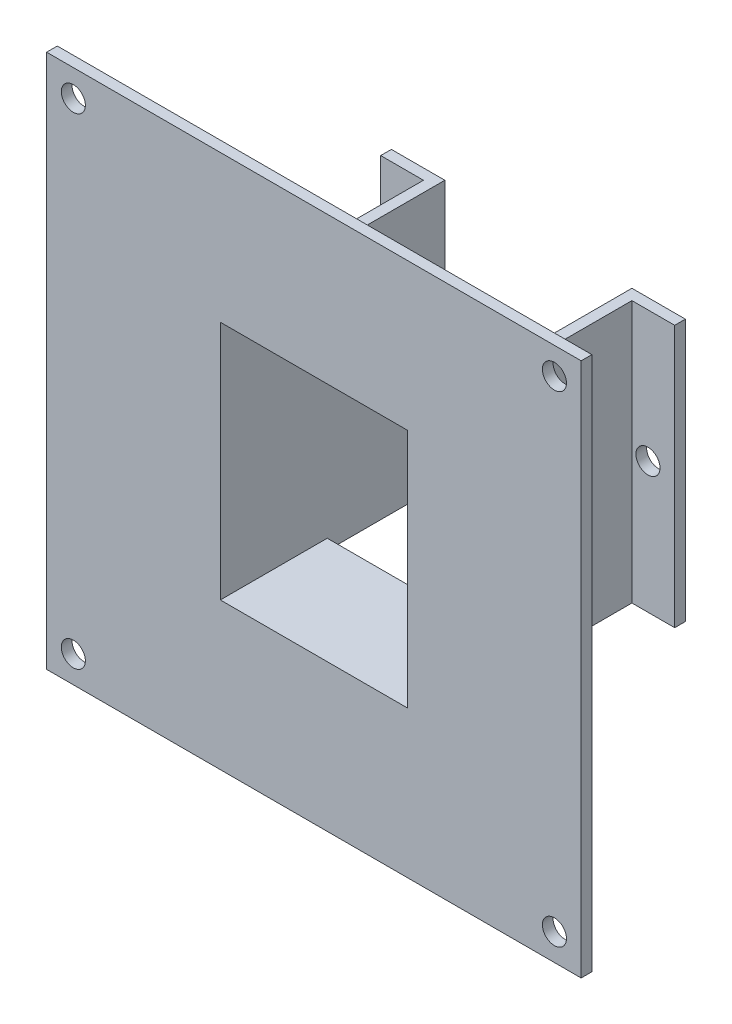
ISO-10303-21;
HEADER;
FILE_DESCRIPTION(('STEP AP214'),'2;1');
FILE_NAME('part.step','',(''),(''),'','','');
FILE_SCHEMA(('AUTOMOTIVE_DESIGN { 1 0 10303 214 1 1 1 1 }'));
ENDSEC;
DATA;
#1=APPLICATION_CONTEXT('core data for automotive mechanical design processes');
#2=APPLICATION_PROTOCOL_DEFINITION('international standard','automotive_design',2000,#1);
#3=PRODUCT_CONTEXT('',#1,'mechanical');
#4=PRODUCT('Part','Part','',(#3));
#5=PRODUCT_RELATED_PRODUCT_CATEGORY('part','',(#4));
#6=PRODUCT_DEFINITION_FORMATION('','',#4);
#7=PRODUCT_DEFINITION_CONTEXT('part definition',#1,'design');
#8=PRODUCT_DEFINITION('design','',#6,#7);
#9=PRODUCT_DEFINITION_SHAPE('','',#8);
#10=(LENGTH_UNIT() NAMED_UNIT(*) SI_UNIT(.MILLI.,.METRE.));
#11=(NAMED_UNIT(*) PLANE_ANGLE_UNIT() SI_UNIT($,.RADIAN.));
#12=(NAMED_UNIT(*) SI_UNIT($,.STERADIAN.) SOLID_ANGLE_UNIT());
#13=UNCERTAINTY_MEASURE_WITH_UNIT(LENGTH_MEASURE(1.E-05),#10,'distance_accuracy_value','');
#14=(GEOMETRIC_REPRESENTATION_CONTEXT(3) GLOBAL_UNCERTAINTY_ASSIGNED_CONTEXT((#13)) GLOBAL_UNIT_ASSIGNED_CONTEXT((#10,
#11,#12)) REPRESENTATION_CONTEXT('',''));
#15=CARTESIAN_POINT('',(0.,0.,0.));
#16=DIRECTION('',(0.,0.,1.));
#17=DIRECTION('',(1.,0.,0.));
#18=AXIS2_PLACEMENT_3D('',#15,#16,#17);
#19=CARTESIAN_POINT('',(-22.5,0.,-40.));
#20=DIRECTION('',(0.,0.,-1.));
#21=DIRECTION('',(-1.,0.,0.));
#22=AXIS2_PLACEMENT_3D('',#19,#20,#21);
#23=CYLINDRICAL_SURFACE('',#22,2.25);
#24=CARTESIAN_POINT('',(-22.5,0.,-38.));
#25=DIRECTION('',(0.,0.,-1.));
#26=DIRECTION('',(-1.,0.,0.));
#27=AXIS2_PLACEMENT_3D('',#24,#25,#26);
#28=CIRCLE('',#27,2.25);
#29=CARTESIAN_POINT('',(-24.75,0.,-38.));
#30=VERTEX_POINT('',#29);
#31=EDGE_CURVE('E19',#30,#30,#28,.F.);
#32=ORIENTED_EDGE('',*,*,#31,.T.);
#33=EDGE_LOOP('',(#32));
#34=FACE_BOUND('',#33,.T.);
#35=CARTESIAN_POINT('',(-22.5,0.,-40.));
#36=DIRECTION('',(0.,0.,-1.));
#37=DIRECTION('',(-1.,0.,0.));
#38=AXIS2_PLACEMENT_3D('',#35,#36,#37);
#39=CIRCLE('',#38,2.25);
#40=CARTESIAN_POINT('',(-24.75,0.,-40.));
#41=VERTEX_POINT('',#40);
#42=EDGE_CURVE('E180',#41,#41,#39,.F.);
#43=ORIENTED_EDGE('',*,*,#42,.F.);
#44=EDGE_LOOP('',(#43));
#45=FACE_BOUND('',#44,.T.);
#46=ADVANCED_FACE('F16',(#34,#45),#23,.F.);
#47=CARTESIAN_POINT('',(22.5,0.,-40.));
#48=DIRECTION('',(0.,0.,-1.));
#49=DIRECTION('',(-1.,0.,0.));
#50=AXIS2_PLACEMENT_3D('',#47,#48,#49);
#51=CYLINDRICAL_SURFACE('',#50,2.25);
#52=CARTESIAN_POINT('',(22.5,0.,-38.));
#53=DIRECTION('',(0.,0.,-1.));
#54=DIRECTION('',(-1.,0.,0.));
#55=AXIS2_PLACEMENT_3D('',#52,#53,#54);
#56=CIRCLE('',#55,2.25);
#57=CARTESIAN_POINT('',(20.25,0.,-38.));
#58=VERTEX_POINT('',#57);
#59=EDGE_CURVE('E190',#58,#58,#56,.F.);
#60=ORIENTED_EDGE('',*,*,#59,.T.);
#61=EDGE_LOOP('',(#60));
#62=FACE_BOUND('',#61,.T.);
#63=CARTESIAN_POINT('',(22.5,0.,-40.));
#64=DIRECTION('',(0.,0.,-1.));
#65=DIRECTION('',(-1.,0.,0.));
#66=AXIS2_PLACEMENT_3D('',#63,#64,#65);
#67=CIRCLE('',#66,2.25);
#68=CARTESIAN_POINT('',(20.25,0.,-40.));
#69=VERTEX_POINT('',#68);
#70=EDGE_CURVE('E214',#69,#69,#67,.F.);
#71=ORIENTED_EDGE('',*,*,#70,.F.);
#72=EDGE_LOOP('',(#71));
#73=FACE_BOUND('',#72,.T.);
#74=ADVANCED_FACE('F238',(#62,#73),#51,.F.);
#75=CARTESIAN_POINT('',(-27.5,-22.5,-40.));
#76=DIRECTION('',(-1.,0.,0.));
#77=DIRECTION('',(0.,0.,1.));
#78=AXIS2_PLACEMENT_3D('',#75,#76,#77);
#79=PLANE('',#78);
#80=DIRECTION('',(0.,0.,1.));
#81=VECTOR('',#80,1.);
#82=CARTESIAN_POINT('',(-27.5,24.5,0.));
#83=LINE('',#82,#81);
#84=CARTESIAN_POINT('',(-27.5,24.5,-40.));
#85=VERTEX_POINT('',#84);
#86=CARTESIAN_POINT('',(-27.5,24.5,-38.));
#87=VERTEX_POINT('',#86);
#88=EDGE_CURVE('E367',#85,#87,#83,.T.);
#89=ORIENTED_EDGE('',*,*,#88,.F.);
#90=DIRECTION('',(0.,1.,0.));
#91=VECTOR('',#90,1.);
#92=CARTESIAN_POINT('',(-27.5,0.,-40.));
#93=LINE('',#92,#91);
#94=CARTESIAN_POINT('',(-27.5,-24.5,-40.));
#95=VERTEX_POINT('',#94);
#96=EDGE_CURVE('E183',#95,#85,#93,.T.);
#97=ORIENTED_EDGE('',*,*,#96,.F.);
#98=DIRECTION('',(0.,0.,-1.));
#99=VECTOR('',#98,1.);
#100=CARTESIAN_POINT('',(-27.5,-24.5,0.));
#101=LINE('',#100,#99);
#102=CARTESIAN_POINT('',(-27.5,-24.5,-38.));
#103=VERTEX_POINT('',#102);
#104=EDGE_CURVE('E172',#103,#95,#101,.T.);
#105=ORIENTED_EDGE('',*,*,#104,.F.);
#106=DIRECTION('',(0.,1.,0.));
#107=VECTOR('',#106,1.);
#108=CARTESIAN_POINT('',(-27.5,0.,-38.));
#109=LINE('',#108,#107);
#110=EDGE_CURVE('E151',#103,#87,#109,.T.);
#111=ORIENTED_EDGE('',*,*,#110,.T.);
#112=EDGE_LOOP('',(#89,#97,#105,#111));
#113=FACE_BOUND('',#112,.T.);
#114=ADVANCED_FACE('F228',(#113),#79,.T.);
#115=CARTESIAN_POINT('',(0.,0.,-38.));
#116=DIRECTION('',(0.,0.,-1.));
#117=DIRECTION('',(-1.,0.,0.));
#118=AXIS2_PLACEMENT_3D('',#115,#116,#117);
#119=PLANE('',#118);
#120=ORIENTED_EDGE('',*,*,#31,.F.);
#121=EDGE_LOOP('',(#120));
#122=FACE_BOUND('',#121,.T.);
#123=ORIENTED_EDGE('',*,*,#110,.F.);
#124=DIRECTION('',(1.,0.,0.));
#125=VECTOR('',#124,1.);
#126=CARTESIAN_POINT('',(-17.5,-24.5,-38.));
#127=LINE('',#126,#125);
#128=CARTESIAN_POINT('',(-19.5,-24.5,-38.));
#129=VERTEX_POINT('',#128);
#130=EDGE_CURVE('E168',#129,#103,#127,.F.);
#131=ORIENTED_EDGE('',*,*,#130,.F.);
#132=DIRECTION('',(0.,1.,0.));
#133=VECTOR('',#132,1.);
#134=CARTESIAN_POINT('',(-19.5,-22.5,-38.));
#135=LINE('',#134,#133);
#136=CARTESIAN_POINT('',(-19.5,24.5,-38.));
#137=VERTEX_POINT('',#136);
#138=EDGE_CURVE('E156',#137,#129,#135,.F.);
#139=ORIENTED_EDGE('',*,*,#138,.F.);
#140=DIRECTION('',(1.,0.,0.));
#141=VECTOR('',#140,1.);
#142=CARTESIAN_POINT('',(-19.5,24.5,-38.));
#143=LINE('',#142,#141);
#144=EDGE_CURVE('E428',#87,#137,#143,.T.);
#145=ORIENTED_EDGE('',*,*,#144,.F.);
#146=EDGE_LOOP('',(#123,#131,#139,#145));
#147=FACE_BOUND('',#146,.T.);
#148=ADVANCED_FACE('F169',(#122,#147),#119,.F.);
#149=CARTESIAN_POINT('',(0.,0.,-38.));
#150=DIRECTION('',(0.,0.,-1.));
#151=DIRECTION('',(-1.,0.,0.));
#152=AXIS2_PLACEMENT_3D('',#149,#150,#151);
#153=PLANE('',#152);
#154=ORIENTED_EDGE('',*,*,#59,.F.);
#155=EDGE_LOOP('',(#154));
#156=FACE_BOUND('',#155,.T.);
#157=DIRECTION('',(0.,1.,0.));
#158=VECTOR('',#157,1.);
#159=CARTESIAN_POINT('',(27.5,22.5,-38.));
#160=LINE('',#159,#158);
#161=CARTESIAN_POINT('',(27.5,24.5,-38.));
#162=VERTEX_POINT('',#161);
#163=CARTESIAN_POINT('',(27.5,-24.5,-38.));
#164=VERTEX_POINT('',#163);
#165=EDGE_CURVE('E165',#162,#164,#160,.F.);
#166=ORIENTED_EDGE('',*,*,#165,.F.);
#167=DIRECTION('',(1.,0.,0.));
#168=VECTOR('',#167,1.);
#169=CARTESIAN_POINT('',(-19.5,24.5,-38.));
#170=LINE('',#169,#168);
#171=CARTESIAN_POINT('',(19.5,24.5,-38.));
#172=VERTEX_POINT('',#171);
#173=EDGE_CURVE('E421',#172,#162,#170,.T.);
#174=ORIENTED_EDGE('',*,*,#173,.F.);
#175=DIRECTION('',(0.,1.,0.));
#176=VECTOR('',#175,1.);
#177=CARTESIAN_POINT('',(19.5,22.5,-38.));
#178=LINE('',#177,#176);
#179=CARTESIAN_POINT('',(19.5,-24.5,-38.));
#180=VERTEX_POINT('',#179);
#181=EDGE_CURVE('E164',#180,#172,#178,.T.);
#182=ORIENTED_EDGE('',*,*,#181,.F.);
#183=DIRECTION('',(1.,0.,0.));
#184=VECTOR('',#183,1.);
#185=CARTESIAN_POINT('',(-17.5,-24.5,-38.));
#186=LINE('',#185,#184);
#187=EDGE_CURVE('E340',#164,#180,#186,.F.);
#188=ORIENTED_EDGE('',*,*,#187,.F.);
#189=EDGE_LOOP('',(#166,#174,#182,#188));
#190=FACE_BOUND('',#189,.T.);
#191=ADVANCED_FACE('F227',(#156,#190),#153,.F.);
#192=CARTESIAN_POINT('',(27.5,22.5,-40.));
#193=DIRECTION('',(1.,0.,0.));
#194=DIRECTION('',(0.,0.,-1.));
#195=AXIS2_PLACEMENT_3D('',#192,#193,#194);
#196=PLANE('',#195);
#197=DIRECTION('',(0.,0.,-1.));
#198=VECTOR('',#197,1.);
#199=CARTESIAN_POINT('',(27.5,-24.5,0.));
#200=LINE('',#199,#198);
#201=CARTESIAN_POINT('',(27.5,-24.5,-40.));
#202=VERTEX_POINT('',#201);
#203=EDGE_CURVE('E333',#202,#164,#200,.F.);
#204=ORIENTED_EDGE('',*,*,#203,.F.);
#205=DIRECTION('',(0.,1.,0.));
#206=VECTOR('',#205,1.);
#207=CARTESIAN_POINT('',(27.5,0.,-40.));
#208=LINE('',#207,#206);
#209=CARTESIAN_POINT('',(27.5,24.5,-40.));
#210=VERTEX_POINT('',#209);
#211=EDGE_CURVE('E337',#210,#202,#208,.F.);
#212=ORIENTED_EDGE('',*,*,#211,.F.);
#213=DIRECTION('',(0.,0.,1.));
#214=VECTOR('',#213,1.);
#215=CARTESIAN_POINT('',(27.5,24.5,0.));
#216=LINE('',#215,#214);
#217=EDGE_CURVE('E419',#162,#210,#216,.F.);
#218=ORIENTED_EDGE('',*,*,#217,.F.);
#219=ORIENTED_EDGE('',*,*,#165,.T.);
#220=EDGE_LOOP('',(#204,#212,#218,#219));
#221=FACE_BOUND('',#220,.T.);
#222=ADVANCED_FACE('F235',(#221),#196,.T.);
#223=CARTESIAN_POINT('',(-19.5,-22.5,0.));
#224=DIRECTION('',(-1.,0.,0.));
#225=DIRECTION('',(0.,0.,1.));
#226=AXIS2_PLACEMENT_3D('',#223,#224,#225);
#227=PLANE('',#226);
#228=DIRECTION('',(0.,0.,1.));
#229=VECTOR('',#228,1.);
#230=CARTESIAN_POINT('',(-19.5,24.5,0.));
#231=LINE('',#230,#229);
#232=CARTESIAN_POINT('',(-19.5,24.5,0.));
#233=VERTEX_POINT('',#232);
#234=EDGE_CURVE('E162',#137,#233,#231,.T.);
#235=ORIENTED_EDGE('',*,*,#234,.F.);
#236=ORIENTED_EDGE('',*,*,#138,.T.);
#237=DIRECTION('',(0.,0.,-1.));
#238=VECTOR('',#237,1.);
#239=CARTESIAN_POINT('',(-19.5,-24.5,0.));
#240=LINE('',#239,#238);
#241=CARTESIAN_POINT('',(-19.5,-24.5,0.));
#242=VERTEX_POINT('',#241);
#243=EDGE_CURVE('E159',#242,#129,#240,.T.);
#244=ORIENTED_EDGE('',*,*,#243,.F.);
#245=DIRECTION('',(0.,1.,0.));
#246=VECTOR('',#245,1.);
#247=CARTESIAN_POINT('',(-19.5,0.,0.));
#248=LINE('',#247,#246);
#249=EDGE_CURVE('E414',#242,#233,#248,.T.);
#250=ORIENTED_EDGE('',*,*,#249,.T.);
#251=EDGE_LOOP('',(#235,#236,#244,#250));
#252=FACE_BOUND('',#251,.T.);
#253=ADVANCED_FACE('F157',(#252),#227,.T.);
#254=CARTESIAN_POINT('',(19.5,22.5,0.));
#255=DIRECTION('',(1.,0.,0.));
#256=DIRECTION('',(0.,0.,-1.));
#257=AXIS2_PLACEMENT_3D('',#254,#255,#256);
#258=PLANE('',#257);
#259=DIRECTION('',(0.,0.,-1.));
#260=VECTOR('',#259,1.);
#261=CARTESIAN_POINT('',(19.5,-24.5,0.));
#262=LINE('',#261,#260);
#263=CARTESIAN_POINT('',(19.5,-24.5,0.));
#264=VERTEX_POINT('',#263);
#265=EDGE_CURVE('E353',#180,#264,#262,.F.);
#266=ORIENTED_EDGE('',*,*,#265,.F.);
#267=ORIENTED_EDGE('',*,*,#181,.T.);
#268=DIRECTION('',(0.,0.,1.));
#269=VECTOR('',#268,1.);
#270=CARTESIAN_POINT('',(19.5,24.5,0.));
#271=LINE('',#270,#269);
#272=CARTESIAN_POINT('',(19.5,24.5,0.));
#273=VERTEX_POINT('',#272);
#274=EDGE_CURVE('E424',#273,#172,#271,.F.);
#275=ORIENTED_EDGE('',*,*,#274,.F.);
#276=DIRECTION('',(0.,1.,0.));
#277=VECTOR('',#276,1.);
#278=CARTESIAN_POINT('',(19.5,0.,0.));
#279=LINE('',#278,#277);
#280=EDGE_CURVE('E409',#273,#264,#279,.F.);
#281=ORIENTED_EDGE('',*,*,#280,.T.);
#282=EDGE_LOOP('',(#266,#267,#275,#281));
#283=FACE_BOUND('',#282,.T.);
#284=ADVANCED_FACE('F321',(#283),#258,.T.);
#285=CARTESIAN_POINT('',(0.,0.,-40.));
#286=DIRECTION('',(0.,0.,-1.));
#287=DIRECTION('',(-1.,0.,0.));
#288=AXIS2_PLACEMENT_3D('',#285,#286,#287);
#289=PLANE('',#288);
#290=ORIENTED_EDGE('',*,*,#42,.T.);
#291=EDGE_LOOP('',(#290));
#292=FACE_BOUND('',#291,.T.);
#293=ORIENTED_EDGE('',*,*,#96,.T.);
#294=DIRECTION('',(1.,0.,0.));
#295=VECTOR('',#294,1.);
#296=CARTESIAN_POINT('',(-19.5,24.5,-40.));
#297=LINE('',#296,#295);
#298=CARTESIAN_POINT('',(-17.5,24.5,-40.));
#299=VERTEX_POINT('',#298);
#300=EDGE_CURVE('E216',#299,#85,#297,.F.);
#301=ORIENTED_EDGE('',*,*,#300,.F.);
#302=DIRECTION('',(0.,1.,0.));
#303=VECTOR('',#302,1.);
#304=CARTESIAN_POINT('',(-17.5,22.5,-40.));
#305=LINE('',#304,#303);
#306=CARTESIAN_POINT('',(-17.5,-24.5,-40.));
#307=VERTEX_POINT('',#306);
#308=EDGE_CURVE('E371',#299,#307,#305,.F.);
#309=ORIENTED_EDGE('',*,*,#308,.T.);
#310=DIRECTION('',(1.,0.,0.));
#311=VECTOR('',#310,1.);
#312=CARTESIAN_POINT('',(-17.5,-24.5,-40.));
#313=LINE('',#312,#311);
#314=EDGE_CURVE('E360',#95,#307,#313,.T.);
#315=ORIENTED_EDGE('',*,*,#314,.F.);
#316=EDGE_LOOP('',(#293,#301,#309,#315));
#317=FACE_BOUND('',#316,.T.);
#318=ADVANCED_FACE('F317',(#292,#317),#289,.T.);
#319=CARTESIAN_POINT('',(0.,0.,-18.));
#320=DIRECTION('',(0.,0.,1.));
#321=DIRECTION('',(1.,0.,0.));
#322=AXIS2_PLACEMENT_3D('',#319,#320,#321);
#323=PLANE('',#322);
#324=DIRECTION('',(1.,0.,0.));
#325=VECTOR('',#324,1.);
#326=CARTESIAN_POINT('',(-17.5,-24.5,-18.));
#327=LINE('',#326,#325);
#328=CARTESIAN_POINT('',(-17.5,-24.5,-18.));
#329=VERTEX_POINT('',#328);
#330=CARTESIAN_POINT('',(17.5,-24.5,-18.));
#331=VERTEX_POINT('',#330);
#332=EDGE_CURVE('E341',#329,#331,#327,.T.);
#333=ORIENTED_EDGE('',*,*,#332,.F.);
#334=DIRECTION('',(0.,1.,0.));
#335=VECTOR('',#334,1.);
#336=CARTESIAN_POINT('',(-17.5,22.5,-18.));
#337=LINE('',#336,#335);
#338=CARTESIAN_POINT('',(-17.5,-22.5,-18.));
#339=VERTEX_POINT('',#338);
#340=EDGE_CURVE('E377',#329,#339,#337,.T.);
#341=ORIENTED_EDGE('',*,*,#340,.T.);
#342=DIRECTION('',(1.,0.,0.));
#343=VECTOR('',#342,1.);
#344=CARTESIAN_POINT('',(-17.5,-22.5,-18.));
#345=LINE('',#344,#343);
#346=CARTESIAN_POINT('',(17.5,-22.5,-18.));
#347=VERTEX_POINT('',#346);
#348=EDGE_CURVE('E385',#339,#347,#345,.T.);
#349=ORIENTED_EDGE('',*,*,#348,.T.);
#350=DIRECTION('',(0.,1.,0.));
#351=VECTOR('',#350,1.);
#352=CARTESIAN_POINT('',(17.5,-22.5,-18.));
#353=LINE('',#352,#351);
#354=EDGE_CURVE('E481',#347,#331,#353,.F.);
#355=ORIENTED_EDGE('',*,*,#354,.T.);
#356=EDGE_LOOP('',(#333,#341,#349,#355));
#357=FACE_BOUND('',#356,.T.);
#358=ADVANCED_FACE('F314',(#357),#323,.F.);
#359=CARTESIAN_POINT('',(-17.5,-24.5,0.));
#360=DIRECTION('',(0.,-1.,0.));
#361=DIRECTION('',(0.,0.,-1.));
#362=AXIS2_PLACEMENT_3D('',#359,#360,#361);
#363=PLANE('',#362);
#364=ORIENTED_EDGE('',*,*,#187,.T.);
#365=ORIENTED_EDGE('',*,*,#265,.T.);
#366=DIRECTION('',(1.,0.,0.));
#367=VECTOR('',#366,1.);
#368=CARTESIAN_POINT('',(0.,-24.5,0.));
#369=LINE('',#368,#367);
#370=EDGE_CURVE('E178',#264,#242,#369,.F.);
#371=ORIENTED_EDGE('',*,*,#370,.T.);
#372=ORIENTED_EDGE('',*,*,#243,.T.);
#373=ORIENTED_EDGE('',*,*,#130,.T.);
#374=ORIENTED_EDGE('',*,*,#104,.T.);
#375=ORIENTED_EDGE('',*,*,#314,.T.);
#376=DIRECTION('',(0.,0.,1.));
#377=VECTOR('',#376,1.);
#378=CARTESIAN_POINT('',(-17.5,-24.5,2.));
#379=LINE('',#378,#377);
#380=EDGE_CURVE('E374',#307,#329,#379,.T.);
#381=ORIENTED_EDGE('',*,*,#380,.T.);
#382=ORIENTED_EDGE('',*,*,#332,.T.);
#383=DIRECTION('',(0.,0.,-1.));
#384=VECTOR('',#383,1.);
#385=CARTESIAN_POINT('',(17.5,-24.5,2.));
#386=LINE('',#385,#384);
#387=CARTESIAN_POINT('',(17.5,-24.5,-40.));
#388=VERTEX_POINT('',#387);
#389=EDGE_CURVE('E346',#331,#388,#386,.T.);
#390=ORIENTED_EDGE('',*,*,#389,.T.);
#391=DIRECTION('',(-1.,0.,0.));
#392=VECTOR('',#391,1.);
#393=CARTESIAN_POINT('',(0.,-24.5,-40.));
#394=LINE('',#393,#392);
#395=EDGE_CURVE('E217',#202,#388,#394,.T.);
#396=ORIENTED_EDGE('',*,*,#395,.F.);
#397=ORIENTED_EDGE('',*,*,#203,.T.);
#398=EDGE_LOOP('',(#364,#365,#371,#372,#373,#374,#375,#381,#382,#390,#396,#397));
#399=FACE_BOUND('',#398,.T.);
#400=ADVANCED_FACE('F175',(#399),#363,.T.);
#401=CARTESIAN_POINT('',(0.,0.,-40.));
#402=DIRECTION('',(0.,0.,-1.));
#403=DIRECTION('',(-1.,0.,0.));
#404=AXIS2_PLACEMENT_3D('',#401,#402,#403);
#405=PLANE('',#404);
#406=ORIENTED_EDGE('',*,*,#70,.T.);
#407=EDGE_LOOP('',(#406));
#408=FACE_BOUND('',#407,.T.);
#409=ORIENTED_EDGE('',*,*,#211,.T.);
#410=ORIENTED_EDGE('',*,*,#395,.T.);
#411=DIRECTION('',(0.,1.,0.));
#412=VECTOR('',#411,1.);
#413=CARTESIAN_POINT('',(17.5,-22.5,-40.));
#414=LINE('',#413,#412);
#415=CARTESIAN_POINT('',(17.5,24.5,-40.));
#416=VERTEX_POINT('',#415);
#417=EDGE_CURVE('E478',#388,#416,#414,.T.);
#418=ORIENTED_EDGE('',*,*,#417,.T.);
#419=DIRECTION('',(1.,0.,0.));
#420=VECTOR('',#419,1.);
#421=CARTESIAN_POINT('',(-19.5,24.5,-40.));
#422=LINE('',#421,#420);
#423=EDGE_CURVE('E351',#210,#416,#422,.F.);
#424=ORIENTED_EDGE('',*,*,#423,.F.);
#425=EDGE_LOOP('',(#409,#410,#418,#424));
#426=FACE_BOUND('',#425,.T.);
#427=ADVANCED_FACE('F307',(#408,#426),#405,.T.);
#428=CARTESIAN_POINT('',(-19.5,24.5,0.));
#429=DIRECTION('',(0.,1.,0.));
#430=DIRECTION('',(0.,0.,1.));
#431=AXIS2_PLACEMENT_3D('',#428,#429,#430);
#432=PLANE('',#431);
#433=ORIENTED_EDGE('',*,*,#217,.T.);
#434=ORIENTED_EDGE('',*,*,#423,.T.);
#435=DIRECTION('',(0.,0.,-1.));
#436=VECTOR('',#435,1.);
#437=CARTESIAN_POINT('',(17.5,24.5,2.));
#438=LINE('',#437,#436);
#439=CARTESIAN_POINT('',(17.5,24.5,-18.));
#440=VERTEX_POINT('',#439);
#441=EDGE_CURVE('E476',#416,#440,#438,.F.);
#442=ORIENTED_EDGE('',*,*,#441,.T.);
#443=DIRECTION('',(1.,0.,0.));
#444=VECTOR('',#443,1.);
#445=CARTESIAN_POINT('',(0.,24.5,-18.));
#446=LINE('',#445,#444);
#447=CARTESIAN_POINT('',(-17.5,24.5,-18.));
#448=VERTEX_POINT('',#447);
#449=EDGE_CURVE('E416',#440,#448,#446,.F.);
#450=ORIENTED_EDGE('',*,*,#449,.T.);
#451=DIRECTION('',(0.,0.,1.));
#452=VECTOR('',#451,1.);
#453=CARTESIAN_POINT('',(-17.5,24.5,2.));
#454=LINE('',#453,#452);
#455=EDGE_CURVE('E375',#448,#299,#454,.F.);
#456=ORIENTED_EDGE('',*,*,#455,.T.);
#457=ORIENTED_EDGE('',*,*,#300,.T.);
#458=ORIENTED_EDGE('',*,*,#88,.T.);
#459=ORIENTED_EDGE('',*,*,#144,.T.);
#460=ORIENTED_EDGE('',*,*,#234,.T.);
#461=DIRECTION('',(1.,0.,0.));
#462=VECTOR('',#461,1.);
#463=CARTESIAN_POINT('',(0.,24.5,0.));
#464=LINE('',#463,#462);
#465=EDGE_CURVE('E411',#233,#273,#464,.T.);
#466=ORIENTED_EDGE('',*,*,#465,.T.);
#467=ORIENTED_EDGE('',*,*,#274,.T.);
#468=ORIENTED_EDGE('',*,*,#173,.T.);
#469=EDGE_LOOP('',(#433,#434,#442,#450,#456,#457,#458,#459,#460,#466,#467,#468));
#470=FACE_BOUND('',#469,.T.);
#471=ADVANCED_FACE('F303',(#470),#432,.T.);
#472=CARTESIAN_POINT('',(0.,0.,-18.));
#473=DIRECTION('',(0.,0.,1.));
#474=DIRECTION('',(1.,0.,0.));
#475=AXIS2_PLACEMENT_3D('',#472,#473,#474);
#476=PLANE('',#475);
#477=ORIENTED_EDGE('',*,*,#449,.F.);
#478=DIRECTION('',(0.,1.,0.));
#479=VECTOR('',#478,1.);
#480=CARTESIAN_POINT('',(17.5,-22.5,-18.));
#481=LINE('',#480,#479);
#482=CARTESIAN_POINT('',(17.5,22.5,-18.));
#483=VERTEX_POINT('',#482);
#484=EDGE_CURVE('E438',#440,#483,#481,.F.);
#485=ORIENTED_EDGE('',*,*,#484,.T.);
#486=DIRECTION('',(1.,0.,0.));
#487=VECTOR('',#486,1.);
#488=CARTESIAN_POINT('',(17.5,22.5,-18.));
#489=LINE('',#488,#487);
#490=CARTESIAN_POINT('',(-17.5,22.5,-18.));
#491=VERTEX_POINT('',#490);
#492=EDGE_CURVE('E436',#483,#491,#489,.F.);
#493=ORIENTED_EDGE('',*,*,#492,.T.);
#494=DIRECTION('',(0.,1.,0.));
#495=VECTOR('',#494,1.);
#496=CARTESIAN_POINT('',(-17.5,22.5,-18.));
#497=LINE('',#496,#495);
#498=EDGE_CURVE('E379',#491,#448,#497,.T.);
#499=ORIENTED_EDGE('',*,*,#498,.T.);
#500=EDGE_LOOP('',(#477,#485,#493,#499));
#501=FACE_BOUND('',#500,.T.);
#502=ADVANCED_FACE('F299',(#501),#476,.F.);
#503=CARTESIAN_POINT('',(0.,0.,0.));
#504=DIRECTION('',(0.,0.,1.));
#505=DIRECTION('',(1.,0.,0.));
#506=AXIS2_PLACEMENT_3D('',#503,#504,#505);
#507=PLANE('',#506);
#508=ORIENTED_EDGE('',*,*,#280,.F.);
#509=ORIENTED_EDGE('',*,*,#465,.F.);
#510=ORIENTED_EDGE('',*,*,#249,.F.);
#511=ORIENTED_EDGE('',*,*,#370,.F.);
#512=EDGE_LOOP('',(#508,#509,#510,#511));
#513=FACE_BOUND('',#512,.T.);
#514=CARTESIAN_POINT('',(-45.,-45.,0.));
#515=DIRECTION('',(0.,0.,1.));
#516=DIRECTION('',(1.,0.,0.));
#517=AXIS2_PLACEMENT_3D('',#514,#515,#516);
#518=CIRCLE('',#517,2.25);
#519=CARTESIAN_POINT('',(-42.75,-45.,0.));
#520=VERTEX_POINT('',#519);
#521=EDGE_CURVE('E201',#520,#520,#518,.T.);
#522=ORIENTED_EDGE('',*,*,#521,.T.);
#523=EDGE_LOOP('',(#522));
#524=FACE_BOUND('',#523,.T.);
#525=CARTESIAN_POINT('',(45.,-45.,0.));
#526=DIRECTION('',(0.,0.,1.));
#527=DIRECTION('',(1.,0.,0.));
#528=AXIS2_PLACEMENT_3D('',#525,#526,#527);
#529=CIRCLE('',#528,2.25);
#530=CARTESIAN_POINT('',(47.25,-45.,0.));
#531=VERTEX_POINT('',#530);
#532=EDGE_CURVE('E205',#531,#531,#529,.T.);
#533=ORIENTED_EDGE('',*,*,#532,.T.);
#534=EDGE_LOOP('',(#533));
#535=FACE_BOUND('',#534,.T.);
#536=CARTESIAN_POINT('',(45.,45.,0.));
#537=DIRECTION('',(0.,0.,1.));
#538=DIRECTION('',(1.,0.,0.));
#539=AXIS2_PLACEMENT_3D('',#536,#537,#538);
#540=CIRCLE('',#539,2.25);
#541=CARTESIAN_POINT('',(47.25,45.,0.));
#542=VERTEX_POINT('',#541);
#543=EDGE_CURVE('E208',#542,#542,#540,.T.);
#544=ORIENTED_EDGE('',*,*,#543,.T.);
#545=EDGE_LOOP('',(#544));
#546=FACE_BOUND('',#545,.T.);
#547=CARTESIAN_POINT('',(-45.,45.,0.));
#548=DIRECTION('',(0.,0.,1.));
#549=DIRECTION('',(1.,0.,0.));
#550=AXIS2_PLACEMENT_3D('',#547,#548,#549);
#551=CIRCLE('',#550,2.25);
#552=CARTESIAN_POINT('',(-42.75,45.,0.));
#553=VERTEX_POINT('',#552);
#554=EDGE_CURVE('E211',#553,#553,#551,.T.);
#555=ORIENTED_EDGE('',*,*,#554,.T.);
#556=EDGE_LOOP('',(#555));
#557=FACE_BOUND('',#556,.T.);
#558=DIRECTION('',(0.,1.,0.));
#559=VECTOR('',#558,1.);
#560=CARTESIAN_POINT('',(50.,-50.,0.));
#561=LINE('',#560,#559);
#562=CARTESIAN_POINT('',(50.,-50.,0.));
#563=VERTEX_POINT('',#562);
#564=CARTESIAN_POINT('',(50.,50.,0.));
#565=VERTEX_POINT('',#564);
#566=EDGE_CURVE('E401',#563,#565,#561,.T.);
#567=ORIENTED_EDGE('',*,*,#566,.F.);
#568=DIRECTION('',(1.,0.,0.));
#569=VECTOR('',#568,1.);
#570=CARTESIAN_POINT('',(-50.,-50.,0.));
#571=LINE('',#570,#569);
#572=CARTESIAN_POINT('',(-50.,-50.,0.));
#573=VERTEX_POINT('',#572);
#574=EDGE_CURVE('E406',#573,#563,#571,.T.);
#575=ORIENTED_EDGE('',*,*,#574,.F.);
#576=DIRECTION('',(0.,1.,0.));
#577=VECTOR('',#576,1.);
#578=CARTESIAN_POINT('',(-50.,50.,0.));
#579=LINE('',#578,#577);
#580=CARTESIAN_POINT('',(-50.,50.,0.));
#581=VERTEX_POINT('',#580);
#582=EDGE_CURVE('E387',#581,#573,#579,.F.);
#583=ORIENTED_EDGE('',*,*,#582,.F.);
#584=DIRECTION('',(1.,0.,0.));
#585=VECTOR('',#584,1.);
#586=CARTESIAN_POINT('',(50.,50.,0.));
#587=LINE('',#586,#585);
#588=EDGE_CURVE('E396',#565,#581,#587,.F.);
#589=ORIENTED_EDGE('',*,*,#588,.F.);
#590=EDGE_LOOP('',(#567,#575,#583,#589));
#591=FACE_BOUND('',#590,.T.);
#592=ADVANCED_FACE('F295',(#513,#524,#535,#546,#557,#591),#507,.F.);
#593=CARTESIAN_POINT('',(-50.,-50.,0.));
#594=DIRECTION('',(0.,-1.,0.));
#595=DIRECTION('',(0.,0.,-1.));
#596=AXIS2_PLACEMENT_3D('',#593,#594,#595);
#597=PLANE('',#596);
#598=DIRECTION('',(0.,0.,1.));
#599=VECTOR('',#598,1.);
#600=CARTESIAN_POINT('',(-50.,-50.,0.));
#601=LINE('',#600,#599);
#602=CARTESIAN_POINT('',(-50.,-50.,2.));
#603=VERTEX_POINT('',#602);
#604=EDGE_CURVE('E393',#573,#603,#601,.T.);
#605=ORIENTED_EDGE('',*,*,#604,.F.);
#606=ORIENTED_EDGE('',*,*,#574,.T.);
#607=DIRECTION('',(0.,0.,-1.));
#608=VECTOR('',#607,1.);
#609=CARTESIAN_POINT('',(50.,-50.,0.));
#610=LINE('',#609,#608);
#611=CARTESIAN_POINT('',(50.,-50.,2.));
#612=VERTEX_POINT('',#611);
#613=EDGE_CURVE('E403',#612,#563,#610,.T.);
#614=ORIENTED_EDGE('',*,*,#613,.F.);
#615=DIRECTION('',(1.,0.,0.));
#616=VECTOR('',#615,1.);
#617=CARTESIAN_POINT('',(0.,-50.,2.));
#618=LINE('',#617,#616);
#619=EDGE_CURVE('E204',#603,#612,#618,.T.);
#620=ORIENTED_EDGE('',*,*,#619,.F.);
#621=EDGE_LOOP('',(#605,#606,#614,#620));
#622=FACE_BOUND('',#621,.T.);
#623=ADVANCED_FACE('F291',(#622),#597,.T.);
#624=CARTESIAN_POINT('',(50.,-50.,0.));
#625=DIRECTION('',(1.,0.,0.));
#626=DIRECTION('',(0.,0.,-1.));
#627=AXIS2_PLACEMENT_3D('',#624,#625,#626);
#628=PLANE('',#627);
#629=ORIENTED_EDGE('',*,*,#613,.T.);
#630=ORIENTED_EDGE('',*,*,#566,.T.);
#631=DIRECTION('',(0.,0.,1.));
#632=VECTOR('',#631,1.);
#633=CARTESIAN_POINT('',(50.,50.,0.));
#634=LINE('',#633,#632);
#635=CARTESIAN_POINT('',(50.,50.,2.));
#636=VERTEX_POINT('',#635);
#637=EDGE_CURVE('E398',#636,#565,#634,.F.);
#638=ORIENTED_EDGE('',*,*,#637,.F.);
#639=DIRECTION('',(0.,1.,0.));
#640=VECTOR('',#639,1.);
#641=CARTESIAN_POINT('',(50.,0.,2.));
#642=LINE('',#641,#640);
#643=EDGE_CURVE('E469',#612,#636,#642,.T.);
#644=ORIENTED_EDGE('',*,*,#643,.F.);
#645=EDGE_LOOP('',(#629,#630,#638,#644));
#646=FACE_BOUND('',#645,.T.);
#647=ADVANCED_FACE('F287',(#646),#628,.T.);
#648=CARTESIAN_POINT('',(50.,50.,0.));
#649=DIRECTION('',(0.,1.,0.));
#650=DIRECTION('',(0.,0.,1.));
#651=AXIS2_PLACEMENT_3D('',#648,#649,#650);
#652=PLANE('',#651);
#653=ORIENTED_EDGE('',*,*,#637,.T.);
#654=ORIENTED_EDGE('',*,*,#588,.T.);
#655=DIRECTION('',(0.,0.,1.));
#656=VECTOR('',#655,1.);
#657=CARTESIAN_POINT('',(-50.,50.,0.));
#658=LINE('',#657,#656);
#659=CARTESIAN_POINT('',(-50.,50.,2.));
#660=VERTEX_POINT('',#659);
#661=EDGE_CURVE('E390',#660,#581,#658,.F.);
#662=ORIENTED_EDGE('',*,*,#661,.F.);
#663=DIRECTION('',(1.,0.,0.));
#664=VECTOR('',#663,1.);
#665=CARTESIAN_POINT('',(0.,50.,2.));
#666=LINE('',#665,#664);
#667=EDGE_CURVE('E463',#636,#660,#666,.F.);
#668=ORIENTED_EDGE('',*,*,#667,.F.);
#669=EDGE_LOOP('',(#653,#654,#662,#668));
#670=FACE_BOUND('',#669,.T.);
#671=ADVANCED_FACE('F283',(#670),#652,.T.);
#672=CARTESIAN_POINT('',(-50.,50.,0.));
#673=DIRECTION('',(-1.,0.,0.));
#674=DIRECTION('',(0.,0.,1.));
#675=AXIS2_PLACEMENT_3D('',#672,#673,#674);
#676=PLANE('',#675);
#677=ORIENTED_EDGE('',*,*,#661,.T.);
#678=ORIENTED_EDGE('',*,*,#582,.T.);
#679=ORIENTED_EDGE('',*,*,#604,.T.);
#680=DIRECTION('',(0.,1.,0.));
#681=VECTOR('',#680,1.);
#682=CARTESIAN_POINT('',(-50.,0.,2.));
#683=LINE('',#682,#681);
#684=EDGE_CURVE('E460',#660,#603,#683,.F.);
#685=ORIENTED_EDGE('',*,*,#684,.F.);
#686=EDGE_LOOP('',(#677,#678,#679,#685));
#687=FACE_BOUND('',#686,.T.);
#688=ADVANCED_FACE('F279',(#687),#676,.T.);
#689=CARTESIAN_POINT('',(-17.5,-22.5,2.));
#690=DIRECTION('',(0.,-1.,0.));
#691=DIRECTION('',(0.,0.,-1.));
#692=AXIS2_PLACEMENT_3D('',#689,#690,#691);
#693=PLANE('',#692);
#694=DIRECTION('',(0.,0.,-1.));
#695=VECTOR('',#694,1.);
#696=CARTESIAN_POINT('',(17.5,-22.5,2.));
#697=LINE('',#696,#695);
#698=CARTESIAN_POINT('',(17.5,-22.5,2.));
#699=VERTEX_POINT('',#698);
#700=EDGE_CURVE('E439',#699,#347,#697,.T.);
#701=ORIENTED_EDGE('',*,*,#700,.T.);
#702=ORIENTED_EDGE('',*,*,#348,.F.);
#703=DIRECTION('',(0.,0.,1.));
#704=VECTOR('',#703,1.);
#705=CARTESIAN_POINT('',(-17.5,-22.5,2.));
#706=LINE('',#705,#704);
#707=CARTESIAN_POINT('',(-17.5,-22.5,2.));
#708=VERTEX_POINT('',#707);
#709=EDGE_CURVE('E444',#339,#708,#706,.T.);
#710=ORIENTED_EDGE('',*,*,#709,.T.);
#711=DIRECTION('',(1.,0.,0.));
#712=VECTOR('',#711,1.);
#713=CARTESIAN_POINT('',(0.,-22.5,2.));
#714=LINE('',#713,#712);
#715=EDGE_CURVE('E456',#699,#708,#714,.F.);
#716=ORIENTED_EDGE('',*,*,#715,.F.);
#717=EDGE_LOOP('',(#701,#702,#710,#716));
#718=FACE_BOUND('',#717,.T.);
#719=ADVANCED_FACE('F275',(#718),#693,.F.);
#720=CARTESIAN_POINT('',(-17.5,22.5,2.));
#721=DIRECTION('',(-1.,0.,0.));
#722=DIRECTION('',(0.,0.,1.));
#723=AXIS2_PLACEMENT_3D('',#720,#721,#722);
#724=PLANE('',#723);
#725=ORIENTED_EDGE('',*,*,#709,.F.);
#726=ORIENTED_EDGE('',*,*,#340,.F.);
#727=ORIENTED_EDGE('',*,*,#380,.F.);
#728=ORIENTED_EDGE('',*,*,#308,.F.);
#729=ORIENTED_EDGE('',*,*,#455,.F.);
#730=ORIENTED_EDGE('',*,*,#498,.F.);
#731=DIRECTION('',(0.,0.,1.));
#732=VECTOR('',#731,1.);
#733=CARTESIAN_POINT('',(-17.5,22.5,2.));
#734=LINE('',#733,#732);
#735=CARTESIAN_POINT('',(-17.5,22.5,2.));
#736=VERTEX_POINT('',#735);
#737=EDGE_CURVE('E435',#491,#736,#734,.T.);
#738=ORIENTED_EDGE('',*,*,#737,.T.);
#739=DIRECTION('',(0.,1.,0.));
#740=VECTOR('',#739,1.);
#741=CARTESIAN_POINT('',(-17.5,0.,2.));
#742=LINE('',#741,#740);
#743=EDGE_CURVE('E453',#708,#736,#742,.T.);
#744=ORIENTED_EDGE('',*,*,#743,.F.);
#745=EDGE_LOOP('',(#725,#726,#727,#728,#729,#730,#738,#744));
#746=FACE_BOUND('',#745,.T.);
#747=ADVANCED_FACE('F272',(#746),#724,.F.);
#748=CARTESIAN_POINT('',(17.5,22.5,2.));
#749=DIRECTION('',(0.,1.,0.));
#750=DIRECTION('',(0.,0.,1.));
#751=AXIS2_PLACEMENT_3D('',#748,#749,#750);
#752=PLANE('',#751);
#753=DIRECTION('',(0.,0.,-1.));
#754=VECTOR('',#753,1.);
#755=CARTESIAN_POINT('',(17.5,22.5,2.));
#756=LINE('',#755,#754);
#757=CARTESIAN_POINT('',(17.5,22.5,2.));
#758=VERTEX_POINT('',#757);
#759=EDGE_CURVE('E34',#483,#758,#756,.F.);
#760=ORIENTED_EDGE('',*,*,#759,.T.);
#761=DIRECTION('',(1.,0.,0.));
#762=VECTOR('',#761,1.);
#763=CARTESIAN_POINT('',(0.,22.5,2.));
#764=LINE('',#763,#762);
#765=EDGE_CURVE('E442',#736,#758,#764,.T.);
#766=ORIENTED_EDGE('',*,*,#765,.F.);
#767=ORIENTED_EDGE('',*,*,#737,.F.);
#768=ORIENTED_EDGE('',*,*,#492,.F.);
#769=EDGE_LOOP('',(#760,#766,#767,#768));
#770=FACE_BOUND('',#769,.T.);
#771=ADVANCED_FACE('F268',(#770),#752,.F.);
#772=CARTESIAN_POINT('',(17.5,-22.5,2.));
#773=DIRECTION('',(1.,0.,0.));
#774=DIRECTION('',(0.,0.,-1.));
#775=AXIS2_PLACEMENT_3D('',#772,#773,#774);
#776=PLANE('',#775);
#777=ORIENTED_EDGE('',*,*,#759,.F.);
#778=ORIENTED_EDGE('',*,*,#484,.F.);
#779=ORIENTED_EDGE('',*,*,#441,.F.);
#780=ORIENTED_EDGE('',*,*,#417,.F.);
#781=ORIENTED_EDGE('',*,*,#389,.F.);
#782=ORIENTED_EDGE('',*,*,#354,.F.);
#783=ORIENTED_EDGE('',*,*,#700,.F.);
#784=DIRECTION('',(0.,1.,0.));
#785=VECTOR('',#784,1.);
#786=CARTESIAN_POINT('',(17.5,0.,2.));
#787=LINE('',#786,#785);
#788=EDGE_CURVE('E200',#758,#699,#787,.F.);
#789=ORIENTED_EDGE('',*,*,#788,.F.);
#790=EDGE_LOOP('',(#777,#778,#779,#780,#781,#782,#783,#789));
#791=FACE_BOUND('',#790,.T.);
#792=ADVANCED_FACE('F264',(#791),#776,.F.);
#793=CARTESIAN_POINT('',(-45.,45.,2.));
#794=DIRECTION('',(0.,0.,1.));
#795=DIRECTION('',(1.,0.,0.));
#796=AXIS2_PLACEMENT_3D('',#793,#794,#795);
#797=CYLINDRICAL_SURFACE('',#796,2.25);
#798=CARTESIAN_POINT('',(-45.,45.,2.));
#799=DIRECTION('',(0.,0.,1.));
#800=DIRECTION('',(1.,0.,0.));
#801=AXIS2_PLACEMENT_3D('',#798,#799,#800);
#802=CIRCLE('',#801,2.25);
#803=CARTESIAN_POINT('',(-42.75,45.,2.));
#804=VERTEX_POINT('',#803);
#805=EDGE_CURVE('E197',#804,#804,#802,.F.);
#806=ORIENTED_EDGE('',*,*,#805,.F.);
#807=EDGE_LOOP('',(#806));
#808=FACE_BOUND('',#807,.T.);
#809=ORIENTED_EDGE('',*,*,#554,.F.);
#810=EDGE_LOOP('',(#809));
#811=FACE_BOUND('',#810,.T.);
#812=ADVANCED_FACE('F260',(#808,#811),#797,.F.);
#813=CARTESIAN_POINT('',(45.,45.,2.));
#814=DIRECTION('',(0.,0.,1.));
#815=DIRECTION('',(1.,0.,0.));
#816=AXIS2_PLACEMENT_3D('',#813,#814,#815);
#817=CYLINDRICAL_SURFACE('',#816,2.25);
#818=CARTESIAN_POINT('',(45.,45.,2.));
#819=DIRECTION('',(0.,0.,1.));
#820=DIRECTION('',(1.,0.,0.));
#821=AXIS2_PLACEMENT_3D('',#818,#819,#820);
#822=CIRCLE('',#821,2.25);
#823=CARTESIAN_POINT('',(47.25,45.,2.));
#824=VERTEX_POINT('',#823);
#825=EDGE_CURVE('E194',#824,#824,#822,.F.);
#826=ORIENTED_EDGE('',*,*,#825,.F.);
#827=EDGE_LOOP('',(#826));
#828=FACE_BOUND('',#827,.T.);
#829=ORIENTED_EDGE('',*,*,#543,.F.);
#830=EDGE_LOOP('',(#829));
#831=FACE_BOUND('',#830,.T.);
#832=ADVANCED_FACE('F256',(#828,#831),#817,.F.);
#833=CARTESIAN_POINT('',(45.,-45.,2.));
#834=DIRECTION('',(0.,0.,1.));
#835=DIRECTION('',(1.,0.,0.));
#836=AXIS2_PLACEMENT_3D('',#833,#834,#835);
#837=CYLINDRICAL_SURFACE('',#836,2.25);
#838=CARTESIAN_POINT('',(45.,-45.,2.));
#839=DIRECTION('',(0.,0.,1.));
#840=DIRECTION('',(1.,0.,0.));
#841=AXIS2_PLACEMENT_3D('',#838,#839,#840);
#842=CIRCLE('',#841,2.25);
#843=CARTESIAN_POINT('',(47.25,-45.,2.));
#844=VERTEX_POINT('',#843);
#845=EDGE_CURVE('E25',#844,#844,#842,.F.);
#846=ORIENTED_EDGE('',*,*,#845,.F.);
#847=EDGE_LOOP('',(#846));
#848=FACE_BOUND('',#847,.T.);
#849=ORIENTED_EDGE('',*,*,#532,.F.);
#850=EDGE_LOOP('',(#849));
#851=FACE_BOUND('',#850,.T.);
#852=ADVANCED_FACE('F249',(#848,#851),#837,.F.);
#853=CARTESIAN_POINT('',(-45.,-45.,2.));
#854=DIRECTION('',(0.,0.,1.));
#855=DIRECTION('',(1.,0.,0.));
#856=AXIS2_PLACEMENT_3D('',#853,#854,#855);
#857=CYLINDRICAL_SURFACE('',#856,2.25);
#858=CARTESIAN_POINT('',(-45.,-45.,2.));
#859=DIRECTION('',(0.,0.,1.));
#860=DIRECTION('',(1.,0.,0.));
#861=AXIS2_PLACEMENT_3D('',#858,#859,#860);
#862=CIRCLE('',#861,2.25);
#863=CARTESIAN_POINT('',(-42.75,-45.,2.));
#864=VERTEX_POINT('',#863);
#865=EDGE_CURVE('E11',#864,#864,#862,.F.);
#866=ORIENTED_EDGE('',*,*,#865,.F.);
#867=EDGE_LOOP('',(#866));
#868=FACE_BOUND('',#867,.T.);
#869=ORIENTED_EDGE('',*,*,#521,.F.);
#870=EDGE_LOOP('',(#869));
#871=FACE_BOUND('',#870,.T.);
#872=ADVANCED_FACE('F243',(#868,#871),#857,.F.);
#873=CARTESIAN_POINT('',(0.,0.,2.));
#874=DIRECTION('',(0.,0.,1.));
#875=DIRECTION('',(1.,0.,0.));
#876=AXIS2_PLACEMENT_3D('',#873,#874,#875);
#877=PLANE('',#876);
#878=ORIENTED_EDGE('',*,*,#865,.T.);
#879=EDGE_LOOP('',(#878));
#880=FACE_BOUND('',#879,.T.);
#881=ORIENTED_EDGE('',*,*,#845,.T.);
#882=EDGE_LOOP('',(#881));
#883=FACE_BOUND('',#882,.T.);
#884=ORIENTED_EDGE('',*,*,#825,.T.);
#885=EDGE_LOOP('',(#884));
#886=FACE_BOUND('',#885,.T.);
#887=ORIENTED_EDGE('',*,*,#805,.T.);
#888=EDGE_LOOP('',(#887));
#889=FACE_BOUND('',#888,.T.);
#890=ORIENTED_EDGE('',*,*,#765,.T.);
#891=ORIENTED_EDGE('',*,*,#788,.T.);
#892=ORIENTED_EDGE('',*,*,#715,.T.);
#893=ORIENTED_EDGE('',*,*,#743,.T.);
#894=EDGE_LOOP('',(#890,#891,#892,#893));
#895=FACE_BOUND('',#894,.T.);
#896=ORIENTED_EDGE('',*,*,#667,.T.);
#897=ORIENTED_EDGE('',*,*,#684,.T.);
#898=ORIENTED_EDGE('',*,*,#619,.T.);
#899=ORIENTED_EDGE('',*,*,#643,.T.);
#900=EDGE_LOOP('',(#896,#897,#898,#899));
#901=FACE_BOUND('',#900,.T.);
#902=ADVANCED_FACE('F241',(#880,#883,#886,#889,#895,#901),#877,.T.);
#903=CLOSED_SHELL('',(#46,#74,#114,#148,#191,#222,#253,#284,#318,#358,#400,#427,#471,#502,#592,
#623,#647,#671,#688,#719,#747,#771,#792,#812,#832,#852,#872,#902));
#904=MANIFOLD_SOLID_BREP('B1',#903);
#905=ADVANCED_BREP_SHAPE_REPRESENTATION('',(#18,#904),#14);
#906=SHAPE_DEFINITION_REPRESENTATION(#9,#905);
ENDSEC;
END-ISO-10303-21;
